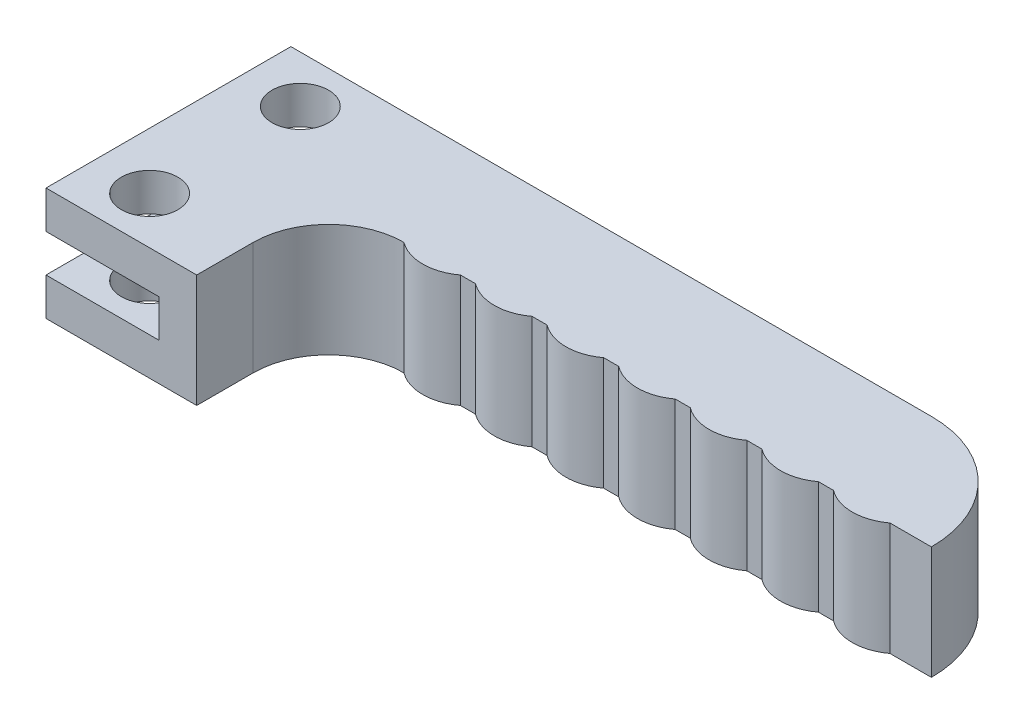
ISO-10303-21;
HEADER;
FILE_DESCRIPTION(('STEP AP214'),'2;1');
FILE_NAME('part.step','',(''),(''),'','','');
FILE_SCHEMA(('AUTOMOTIVE_DESIGN { 1 0 10303 214 1 1 1 1 }'));
ENDSEC;
DATA;
#1=APPLICATION_CONTEXT('core data for automotive mechanical design processes');
#2=APPLICATION_PROTOCOL_DEFINITION('international standard','automotive_design',2000,#1);
#3=PRODUCT_CONTEXT('',#1,'mechanical');
#4=PRODUCT('Part','Part','',(#3));
#5=PRODUCT_RELATED_PRODUCT_CATEGORY('part','',(#4));
#6=PRODUCT_DEFINITION_FORMATION('','',#4);
#7=PRODUCT_DEFINITION_CONTEXT('part definition',#1,'design');
#8=PRODUCT_DEFINITION('design','',#6,#7);
#9=PRODUCT_DEFINITION_SHAPE('','',#8);
#10=(LENGTH_UNIT() NAMED_UNIT(*) SI_UNIT(.MILLI.,.METRE.));
#11=(NAMED_UNIT(*) PLANE_ANGLE_UNIT() SI_UNIT($,.RADIAN.));
#12=(NAMED_UNIT(*) SI_UNIT($,.STERADIAN.) SOLID_ANGLE_UNIT());
#13=UNCERTAINTY_MEASURE_WITH_UNIT(LENGTH_MEASURE(1.E-05),#10,'distance_accuracy_value','');
#14=(GEOMETRIC_REPRESENTATION_CONTEXT(3) GLOBAL_UNCERTAINTY_ASSIGNED_CONTEXT((#13)) GLOBAL_UNIT_ASSIGNED_CONTEXT((#10,
#11,#12)) REPRESENTATION_CONTEXT('',''));
#15=CARTESIAN_POINT('',(0.,0.,0.));
#16=DIRECTION('',(0.,0.,1.));
#17=DIRECTION('',(1.,0.,0.));
#18=AXIS2_PLACEMENT_3D('',#15,#16,#17);
#19=CARTESIAN_POINT('',(4.89999999999997,0.,-2.50000000000009));
#20=DIRECTION('',(0.,1.,0.));
#21=DIRECTION('',(0.,0.,1.));
#22=AXIS2_PLACEMENT_3D('',#19,#20,#21);
#23=CYLINDRICAL_SURFACE('',#22,2.5);
#24=CARTESIAN_POINT('',(4.89999999999997,6.,-2.50000000000009));
#25=DIRECTION('',(0.,1.,0.));
#26=DIRECTION('',(0.,0.,1.));
#27=AXIS2_PLACEMENT_3D('',#24,#25,#26);
#28=CIRCLE('',#27,2.5);
#29=CARTESIAN_POINT('',(6.39999999999991,6.,-0.500000000000001));
#30=VERTEX_POINT('',#29);
#31=CARTESIAN_POINT('',(3.40000000000003,6.,-0.500000000000001));
#32=VERTEX_POINT('',#31);
#33=EDGE_CURVE('E118',#30,#32,#28,.F.);
#34=ORIENTED_EDGE('',*,*,#33,.T.);
#35=DIRECTION('',(0.,1.,0.));
#36=VECTOR('',#35,1.);
#37=CARTESIAN_POINT('',(3.39999999999998,0.,-0.500000000000001));
#38=LINE('',#37,#36);
#39=CARTESIAN_POINT('',(3.40000000000003,0.,-0.500000000000001));
#40=VERTEX_POINT('',#39);
#41=EDGE_CURVE('E128',#32,#40,#38,.F.);
#42=ORIENTED_EDGE('',*,*,#41,.T.);
#43=CARTESIAN_POINT('',(4.89999999999997,0.,-2.50000000000009));
#44=DIRECTION('',(0.,1.,0.));
#45=DIRECTION('',(0.,0.,1.));
#46=AXIS2_PLACEMENT_3D('',#43,#44,#45);
#47=CIRCLE('',#46,2.5);
#48=CARTESIAN_POINT('',(6.39999999999991,0.,-0.500000000000001));
#49=VERTEX_POINT('',#48);
#50=EDGE_CURVE('E20',#40,#49,#47,.T.);
#51=ORIENTED_EDGE('',*,*,#50,.T.);
#52=DIRECTION('',(0.,1.,0.));
#53=VECTOR('',#52,1.);
#54=CARTESIAN_POINT('',(6.39999999999996,0.,-0.500000000000001));
#55=LINE('',#54,#53);
#56=EDGE_CURVE('E125',#49,#30,#55,.T.);
#57=ORIENTED_EDGE('',*,*,#56,.T.);
#58=EDGE_LOOP('',(#34,#42,#51,#57));
#59=FACE_BOUND('',#58,.T.);
#60=ADVANCED_FACE('F17',(#59),#23,.T.);
#61=CARTESIAN_POINT('',(20.,0.,-0.500000000000003));
#62=DIRECTION('',(0.,0.,-1.));
#63=DIRECTION('',(-1.,0.,0.));
#64=AXIS2_PLACEMENT_3D('',#61,#62,#63);
#65=PLANE('',#64);
#66=ORIENTED_EDGE('',*,*,#56,.F.);
#67=DIRECTION('',(-1.,0.,0.));
#68=VECTOR('',#67,1.);
#69=CARTESIAN_POINT('',(20.,0.,-0.500000000000003));
#70=LINE('',#69,#68);
#71=CARTESIAN_POINT('',(7.20000000000005,0.,-0.500000000000054));
#72=VERTEX_POINT('',#71);
#73=EDGE_CURVE('E133',#72,#49,#70,.T.);
#74=ORIENTED_EDGE('',*,*,#73,.F.);
#75=DIRECTION('',(0.,1.,0.));
#76=VECTOR('',#75,1.);
#77=CARTESIAN_POINT('',(7.19999999999998,0.,-0.500000000000106));
#78=LINE('',#77,#76);
#79=CARTESIAN_POINT('',(7.20000000000005,6.,-0.500000000000054));
#80=VERTEX_POINT('',#79);
#81=EDGE_CURVE('E227',#80,#72,#78,.F.);
#82=ORIENTED_EDGE('',*,*,#81,.F.);
#83=DIRECTION('',(-1.,0.,0.));
#84=VECTOR('',#83,1.);
#85=CARTESIAN_POINT('',(20.,6.,-0.500000000000003));
#86=LINE('',#85,#84);
#87=EDGE_CURVE('E144',#30,#80,#86,.F.);
#88=ORIENTED_EDGE('',*,*,#87,.F.);
#89=EDGE_LOOP('',(#66,#74,#82,#88));
#90=FACE_BOUND('',#89,.T.);
#91=ADVANCED_FACE('F143',(#90),#65,.F.);
#92=CARTESIAN_POINT('',(20.,0.,-0.500000000000003));
#93=DIRECTION('',(0.,0.,-1.));
#94=DIRECTION('',(-1.,0.,0.));
#95=AXIS2_PLACEMENT_3D('',#92,#93,#94);
#96=PLANE('',#95);
#97=DIRECTION('',(0.,1.,0.));
#98=VECTOR('',#97,1.);
#99=CARTESIAN_POINT('',(2.59999999999995,0.,-0.500000000000053));
#100=LINE('',#99,#98);
#101=CARTESIAN_POINT('',(2.59999999999992,0.,-0.500000000000027));
#102=VERTEX_POINT('',#101);
#103=CARTESIAN_POINT('',(2.59999999999992,6.,-0.500000000000027));
#104=VERTEX_POINT('',#103);
#105=EDGE_CURVE('E218',#102,#104,#100,.T.);
#106=ORIENTED_EDGE('',*,*,#105,.F.);
#107=DIRECTION('',(-1.,0.,0.));
#108=VECTOR('',#107,1.);
#109=CARTESIAN_POINT('',(20.,0.,-0.500000000000003));
#110=LINE('',#109,#108);
#111=EDGE_CURVE('E228',#40,#102,#110,.T.);
#112=ORIENTED_EDGE('',*,*,#111,.F.);
#113=ORIENTED_EDGE('',*,*,#41,.F.);
#114=DIRECTION('',(-1.,0.,0.));
#115=VECTOR('',#114,1.);
#116=CARTESIAN_POINT('',(20.,6.,-0.500000000000003));
#117=LINE('',#116,#115);
#118=EDGE_CURVE('E220',#104,#32,#117,.F.);
#119=ORIENTED_EDGE('',*,*,#118,.F.);
#120=EDGE_LOOP('',(#106,#112,#113,#119));
#121=FACE_BOUND('',#120,.T.);
#122=ADVANCED_FACE('F230',(#121),#96,.F.);
#123=CARTESIAN_POINT('',(8.69999999999997,0.,-2.50000000000012));
#124=DIRECTION('',(0.,1.,0.));
#125=DIRECTION('',(0.,0.,1.));
#126=AXIS2_PLACEMENT_3D('',#123,#124,#125);
#127=CYLINDRICAL_SURFACE('',#126,2.5);
#128=DIRECTION('',(0.,1.,0.));
#129=VECTOR('',#128,1.);
#130=CARTESIAN_POINT('',(10.2,0.,-0.500000000000002));
#131=LINE('',#130,#129);
#132=CARTESIAN_POINT('',(10.1999999999999,0.,-0.500000000000002));
#133=VERTEX_POINT('',#132);
#134=CARTESIAN_POINT('',(10.1999999999999,6.,-0.500000000000002));
#135=VERTEX_POINT('',#134);
#136=EDGE_CURVE('E237',#133,#135,#131,.T.);
#137=ORIENTED_EDGE('',*,*,#136,.T.);
#138=CARTESIAN_POINT('',(8.69999999999997,6.,-2.50000000000012));
#139=DIRECTION('',(0.,1.,0.));
#140=DIRECTION('',(0.,0.,1.));
#141=AXIS2_PLACEMENT_3D('',#138,#139,#140);
#142=CIRCLE('',#141,2.5);
#143=EDGE_CURVE('E216',#135,#80,#142,.F.);
#144=ORIENTED_EDGE('',*,*,#143,.T.);
#145=ORIENTED_EDGE('',*,*,#81,.T.);
#146=CARTESIAN_POINT('',(8.69999999999997,0.,-2.50000000000012));
#147=DIRECTION('',(0.,1.,0.));
#148=DIRECTION('',(0.,0.,1.));
#149=AXIS2_PLACEMENT_3D('',#146,#147,#148);
#150=CIRCLE('',#149,2.5);
#151=EDGE_CURVE('E138',#72,#133,#150,.T.);
#152=ORIENTED_EDGE('',*,*,#151,.T.);
#153=EDGE_LOOP('',(#137,#144,#145,#152));
#154=FACE_BOUND('',#153,.T.);
#155=ADVANCED_FACE('F468',(#154),#127,.T.);
#156=CARTESIAN_POINT('',(1.09999999999997,0.,-2.50000000000006));
#157=DIRECTION('',(0.,1.,0.));
#158=DIRECTION('',(0.,0.,1.));
#159=AXIS2_PLACEMENT_3D('',#156,#157,#158);
#160=CYLINDRICAL_SURFACE('',#159,2.5);
#161=CARTESIAN_POINT('',(1.09999999999997,6.,-2.50000000000006));
#162=DIRECTION('',(0.,1.,0.));
#163=DIRECTION('',(0.,0.,1.));
#164=AXIS2_PLACEMENT_3D('',#161,#162,#163);
#165=CIRCLE('',#164,2.5);
#166=CARTESIAN_POINT('',(-0.399999999999987,6.,-0.500000000000001));
#167=VERTEX_POINT('',#166);
#168=EDGE_CURVE('E211',#104,#167,#165,.F.);
#169=ORIENTED_EDGE('',*,*,#168,.T.);
#170=DIRECTION('',(0.,1.,0.));
#171=VECTOR('',#170,1.);
#172=CARTESIAN_POINT('',(-0.400000000000022,0.,-0.500000000000001));
#173=LINE('',#172,#171);
#174=CARTESIAN_POINT('',(-0.399999999999987,0.,-0.500000000000001));
#175=VERTEX_POINT('',#174);
#176=EDGE_CURVE('E241',#167,#175,#173,.F.);
#177=ORIENTED_EDGE('',*,*,#176,.T.);
#178=CARTESIAN_POINT('',(1.09999999999997,0.,-2.50000000000006));
#179=DIRECTION('',(0.,1.,0.));
#180=DIRECTION('',(0.,0.,1.));
#181=AXIS2_PLACEMENT_3D('',#178,#179,#180);
#182=CIRCLE('',#181,2.5);
#183=EDGE_CURVE('E214',#175,#102,#182,.T.);
#184=ORIENTED_EDGE('',*,*,#183,.T.);
#185=ORIENTED_EDGE('',*,*,#105,.T.);
#186=EDGE_LOOP('',(#169,#177,#184,#185));
#187=FACE_BOUND('',#186,.T.);
#188=ADVANCED_FACE('F470',(#187),#160,.T.);
#189=CARTESIAN_POINT('',(20.,0.,-0.500000000000003));
#190=DIRECTION('',(0.,0.,-1.));
#191=DIRECTION('',(-1.,0.,0.));
#192=AXIS2_PLACEMENT_3D('',#189,#190,#191);
#193=PLANE('',#192);
#194=ORIENTED_EDGE('',*,*,#136,.F.);
#195=DIRECTION('',(-1.,0.,0.));
#196=VECTOR('',#195,1.);
#197=CARTESIAN_POINT('',(20.,0.,-0.500000000000003));
#198=LINE('',#197,#196);
#199=CARTESIAN_POINT('',(11.0000000000001,0.,-0.500000000000067));
#200=VERTEX_POINT('',#199);
#201=EDGE_CURVE('E213',#200,#133,#198,.T.);
#202=ORIENTED_EDGE('',*,*,#201,.F.);
#203=DIRECTION('',(0.,1.,0.));
#204=VECTOR('',#203,1.);
#205=CARTESIAN_POINT('',(11.,0.,-0.500000000000132));
#206=LINE('',#205,#204);
#207=CARTESIAN_POINT('',(11.0000000000001,6.,-0.500000000000067));
#208=VERTEX_POINT('',#207);
#209=EDGE_CURVE('E248',#208,#200,#206,.F.);
#210=ORIENTED_EDGE('',*,*,#209,.F.);
#211=DIRECTION('',(-1.,0.,0.));
#212=VECTOR('',#211,1.);
#213=CARTESIAN_POINT('',(20.,6.,-0.500000000000003));
#214=LINE('',#213,#212);
#215=EDGE_CURVE('E240',#135,#208,#214,.F.);
#216=ORIENTED_EDGE('',*,*,#215,.F.);
#217=EDGE_LOOP('',(#194,#202,#210,#216));
#218=FACE_BOUND('',#217,.T.);
#219=ADVANCED_FACE('F467',(#218),#193,.F.);
#220=CARTESIAN_POINT('',(20.,0.,-0.500000000000003));
#221=DIRECTION('',(0.,0.,-1.));
#222=DIRECTION('',(-1.,0.,0.));
#223=AXIS2_PLACEMENT_3D('',#220,#221,#222);
#224=PLANE('',#223);
#225=DIRECTION('',(0.,1.,0.));
#226=VECTOR('',#225,1.);
#227=CARTESIAN_POINT('',(-1.20000000000005,0.,-0.500000000000025));
#228=LINE('',#227,#226);
#229=CARTESIAN_POINT('',(-1.20000000000006,0.,-0.500000000000013));
#230=VERTEX_POINT('',#229);
#231=CARTESIAN_POINT('',(-1.20000000000006,6.,-0.500000000000013));
#232=VERTEX_POINT('',#231);
#233=EDGE_CURVE('E210',#230,#232,#228,.T.);
#234=ORIENTED_EDGE('',*,*,#233,.F.);
#235=DIRECTION('',(-1.,0.,0.));
#236=VECTOR('',#235,1.);
#237=CARTESIAN_POINT('',(20.,0.,-0.500000000000003));
#238=LINE('',#237,#236);
#239=EDGE_CURVE('E244',#175,#230,#238,.T.);
#240=ORIENTED_EDGE('',*,*,#239,.F.);
#241=ORIENTED_EDGE('',*,*,#176,.F.);
#242=DIRECTION('',(-1.,0.,0.));
#243=VECTOR('',#242,1.);
#244=CARTESIAN_POINT('',(20.,6.,-0.500000000000003));
#245=LINE('',#244,#243);
#246=EDGE_CURVE('E251',#232,#167,#245,.F.);
#247=ORIENTED_EDGE('',*,*,#246,.F.);
#248=EDGE_LOOP('',(#234,#240,#241,#247));
#249=FACE_BOUND('',#248,.T.);
#250=ADVANCED_FACE('F560',(#249),#224,.F.);
#251=CARTESIAN_POINT('',(12.5,0.,-2.50000000000015));
#252=DIRECTION('',(0.,1.,0.));
#253=DIRECTION('',(0.,0.,1.));
#254=AXIS2_PLACEMENT_3D('',#251,#252,#253);
#255=CYLINDRICAL_SURFACE('',#254,2.5);
#256=DIRECTION('',(0.,1.,0.));
#257=VECTOR('',#256,1.);
#258=CARTESIAN_POINT('',(14.,0.,-0.500000000000002));
#259=LINE('',#258,#257);
#260=CARTESIAN_POINT('',(13.9999999999999,0.,-0.500000000000002));
#261=VERTEX_POINT('',#260);
#262=CARTESIAN_POINT('',(13.9999999999999,6.,-0.500000000000002));
#263=VERTEX_POINT('',#262);
#264=EDGE_CURVE('E257',#261,#263,#259,.T.);
#265=ORIENTED_EDGE('',*,*,#264,.T.);
#266=CARTESIAN_POINT('',(12.5,6.,-2.50000000000015));
#267=DIRECTION('',(0.,1.,0.));
#268=DIRECTION('',(0.,0.,1.));
#269=AXIS2_PLACEMENT_3D('',#266,#267,#268);
#270=CIRCLE('',#269,2.5);
#271=EDGE_CURVE('E205',#263,#208,#270,.F.);
#272=ORIENTED_EDGE('',*,*,#271,.T.);
#273=ORIENTED_EDGE('',*,*,#209,.T.);
#274=CARTESIAN_POINT('',(12.5,0.,-2.50000000000015));
#275=DIRECTION('',(0.,1.,0.));
#276=DIRECTION('',(0.,0.,1.));
#277=AXIS2_PLACEMENT_3D('',#274,#275,#276);
#278=CIRCLE('',#277,2.5);
#279=EDGE_CURVE('E207',#200,#261,#278,.T.);
#280=ORIENTED_EDGE('',*,*,#279,.T.);
#281=EDGE_LOOP('',(#265,#272,#273,#280));
#282=FACE_BOUND('',#281,.T.);
#283=ADVANCED_FACE('F462',(#282),#255,.T.);
#284=CARTESIAN_POINT('',(-2.70000000000003,0.,-2.50000000000004));
#285=DIRECTION('',(0.,1.,0.));
#286=DIRECTION('',(0.,0.,1.));
#287=AXIS2_PLACEMENT_3D('',#284,#285,#286);
#288=CYLINDRICAL_SURFACE('',#287,2.5);
#289=CARTESIAN_POINT('',(-2.70000000000003,6.,-2.50000000000004));
#290=DIRECTION('',(0.,1.,0.));
#291=DIRECTION('',(0.,0.,1.));
#292=AXIS2_PLACEMENT_3D('',#289,#290,#291);
#293=CIRCLE('',#292,2.5);
#294=CARTESIAN_POINT('',(-4.2,6.,-0.5));
#295=VERTEX_POINT('',#294);
#296=EDGE_CURVE('E200',#232,#295,#293,.F.);
#297=ORIENTED_EDGE('',*,*,#296,.T.);
#298=DIRECTION('',(0.,1.,0.));
#299=VECTOR('',#298,1.);
#300=CARTESIAN_POINT('',(-4.20000000000002,0.,-0.5));
#301=LINE('',#300,#299);
#302=CARTESIAN_POINT('',(-4.2,0.,-0.5));
#303=VERTEX_POINT('',#302);
#304=EDGE_CURVE('E261',#295,#303,#301,.F.);
#305=ORIENTED_EDGE('',*,*,#304,.T.);
#306=CARTESIAN_POINT('',(-2.70000000000003,0.,-2.50000000000004));
#307=DIRECTION('',(0.,1.,0.));
#308=DIRECTION('',(0.,0.,1.));
#309=AXIS2_PLACEMENT_3D('',#306,#307,#308);
#310=CIRCLE('',#309,2.5);
#311=EDGE_CURVE('E203',#303,#230,#310,.T.);
#312=ORIENTED_EDGE('',*,*,#311,.T.);
#313=ORIENTED_EDGE('',*,*,#233,.T.);
#314=EDGE_LOOP('',(#297,#305,#312,#313));
#315=FACE_BOUND('',#314,.T.);
#316=ADVANCED_FACE('F554',(#315),#288,.T.);
#317=CARTESIAN_POINT('',(20.,0.,-0.500000000000003));
#318=DIRECTION('',(0.,0.,-1.));
#319=DIRECTION('',(-1.,0.,0.));
#320=AXIS2_PLACEMENT_3D('',#317,#318,#319);
#321=PLANE('',#320);
#322=ORIENTED_EDGE('',*,*,#264,.F.);
#323=DIRECTION('',(-1.,0.,0.));
#324=VECTOR('',#323,1.);
#325=CARTESIAN_POINT('',(20.,0.,-0.500000000000003));
#326=LINE('',#325,#324);
#327=CARTESIAN_POINT('',(14.8000000000001,0.,-0.50000000000008));
#328=VERTEX_POINT('',#327);
#329=EDGE_CURVE('E202',#328,#261,#326,.T.);
#330=ORIENTED_EDGE('',*,*,#329,.F.);
#331=DIRECTION('',(0.,1.,0.));
#332=VECTOR('',#331,1.);
#333=CARTESIAN_POINT('',(14.8,0.,-0.500000000000158));
#334=LINE('',#333,#332);
#335=CARTESIAN_POINT('',(14.8000000000001,6.,-0.50000000000008));
#336=VERTEX_POINT('',#335);
#337=EDGE_CURVE('E267',#336,#328,#334,.F.);
#338=ORIENTED_EDGE('',*,*,#337,.F.);
#339=DIRECTION('',(-1.,0.,0.));
#340=VECTOR('',#339,1.);
#341=CARTESIAN_POINT('',(20.,6.,-0.500000000000003));
#342=LINE('',#341,#340);
#343=EDGE_CURVE('E260',#263,#336,#342,.F.);
#344=ORIENTED_EDGE('',*,*,#343,.F.);
#345=EDGE_LOOP('',(#322,#330,#338,#344));
#346=FACE_BOUND('',#345,.T.);
#347=ADVANCED_FACE('F459',(#346),#321,.F.);
#348=CARTESIAN_POINT('',(20.,0.,-0.500000000000003));
#349=DIRECTION('',(0.,0.,-1.));
#350=DIRECTION('',(-1.,0.,0.));
#351=AXIS2_PLACEMENT_3D('',#348,#349,#350);
#352=PLANE('',#351);
#353=DIRECTION('',(0.,1.,0.));
#354=VECTOR('',#353,1.);
#355=CARTESIAN_POINT('',(-5.00000000000004,0.,-0.5));
#356=LINE('',#355,#354);
#357=CARTESIAN_POINT('',(-5.00000000000004,0.,-0.5));
#358=VERTEX_POINT('',#357);
#359=CARTESIAN_POINT('',(-5.00000000000004,6.,-0.5));
#360=VERTEX_POINT('',#359);
#361=EDGE_CURVE('E199',#358,#360,#356,.T.);
#362=ORIENTED_EDGE('',*,*,#361,.F.);
#363=DIRECTION('',(-1.,0.,0.));
#364=VECTOR('',#363,1.);
#365=CARTESIAN_POINT('',(20.,0.,-0.500000000000003));
#366=LINE('',#365,#364);
#367=EDGE_CURVE('E264',#303,#358,#366,.T.);
#368=ORIENTED_EDGE('',*,*,#367,.F.);
#369=ORIENTED_EDGE('',*,*,#304,.F.);
#370=DIRECTION('',(-1.,0.,0.));
#371=VECTOR('',#370,1.);
#372=CARTESIAN_POINT('',(20.,6.,-0.500000000000003));
#373=LINE('',#372,#371);
#374=EDGE_CURVE('E270',#360,#295,#373,.F.);
#375=ORIENTED_EDGE('',*,*,#374,.F.);
#376=EDGE_LOOP('',(#362,#368,#369,#375));
#377=FACE_BOUND('',#376,.T.);
#378=ADVANCED_FACE('F547',(#377),#352,.F.);
#379=CARTESIAN_POINT('',(-17.,0.,4.));
#380=DIRECTION('',(0.,1.,0.));
#381=DIRECTION('',(0.,0.,1.));
#382=AXIS2_PLACEMENT_3D('',#379,#380,#381);
#383=CYLINDRICAL_SURFACE('',#382,1.5);
#384=CARTESIAN_POINT('',(-17.,0.,4.));
#385=DIRECTION('',(0.,1.,0.));
#386=DIRECTION('',(0.,0.,1.));
#387=AXIS2_PLACEMENT_3D('',#384,#385,#386);
#388=CIRCLE('',#387,1.5);
#389=CARTESIAN_POINT('',(-17.,0.,5.5));
#390=VERTEX_POINT('',#389);
#391=EDGE_CURVE('E185',#390,#390,#388,.F.);
#392=ORIENTED_EDGE('',*,*,#391,.T.);
#393=EDGE_LOOP('',(#392));
#394=FACE_BOUND('',#393,.T.);
#395=CARTESIAN_POINT('',(-17.,2.,4.));
#396=DIRECTION('',(0.,1.,0.));
#397=DIRECTION('',(0.,0.,1.));
#398=AXIS2_PLACEMENT_3D('',#395,#396,#397);
#399=CIRCLE('',#398,1.5);
#400=CARTESIAN_POINT('',(-17.,2.,5.5));
#401=VERTEX_POINT('',#400);
#402=EDGE_CURVE('E194',#401,#401,#399,.T.);
#403=ORIENTED_EDGE('',*,*,#402,.T.);
#404=EDGE_LOOP('',(#403));
#405=FACE_BOUND('',#404,.T.);
#406=ADVANCED_FACE('F543',(#394,#405),#383,.F.);
#407=CARTESIAN_POINT('',(-17.,0.,-4.));
#408=DIRECTION('',(0.,1.,0.));
#409=DIRECTION('',(0.,0.,1.));
#410=AXIS2_PLACEMENT_3D('',#407,#408,#409);
#411=CYLINDRICAL_SURFACE('',#410,1.5);
#412=CARTESIAN_POINT('',(-17.,0.,-4.));
#413=DIRECTION('',(0.,1.,0.));
#414=DIRECTION('',(0.,0.,1.));
#415=AXIS2_PLACEMENT_3D('',#412,#413,#414);
#416=CIRCLE('',#415,1.5);
#417=CARTESIAN_POINT('',(-17.,0.,-2.5));
#418=VERTEX_POINT('',#417);
#419=EDGE_CURVE('E182',#418,#418,#416,.F.);
#420=ORIENTED_EDGE('',*,*,#419,.T.);
#421=EDGE_LOOP('',(#420));
#422=FACE_BOUND('',#421,.T.);
#423=CARTESIAN_POINT('',(-17.,2.,-4.));
#424=DIRECTION('',(0.,1.,0.));
#425=DIRECTION('',(0.,0.,1.));
#426=AXIS2_PLACEMENT_3D('',#423,#424,#425);
#427=CIRCLE('',#426,1.5);
#428=CARTESIAN_POINT('',(-17.,2.,-2.5));
#429=VERTEX_POINT('',#428);
#430=EDGE_CURVE('E190',#429,#429,#427,.T.);
#431=ORIENTED_EDGE('',*,*,#430,.T.);
#432=EDGE_LOOP('',(#431));
#433=FACE_BOUND('',#432,.T.);
#434=ADVANCED_FACE('F540',(#422,#433),#411,.F.);
#435=CARTESIAN_POINT('',(16.3,0.,-2.50000000000018));
#436=DIRECTION('',(0.,1.,0.));
#437=DIRECTION('',(0.,0.,1.));
#438=AXIS2_PLACEMENT_3D('',#435,#436,#437);
#439=CYLINDRICAL_SURFACE('',#438,2.5);
#440=DIRECTION('',(0.,1.,0.));
#441=VECTOR('',#440,1.);
#442=CARTESIAN_POINT('',(17.7999999999999,0.,-0.500000000000003));
#443=LINE('',#442,#441);
#444=CARTESIAN_POINT('',(17.7999999999998,0.,-0.500000000000003));
#445=VERTEX_POINT('',#444);
#446=CARTESIAN_POINT('',(17.7999999999998,6.,-0.500000000000003));
#447=VERTEX_POINT('',#446);
#448=EDGE_CURVE('E279',#445,#447,#443,.T.);
#449=ORIENTED_EDGE('',*,*,#448,.T.);
#450=CARTESIAN_POINT('',(16.3,6.,-2.50000000000018));
#451=DIRECTION('',(0.,1.,0.));
#452=DIRECTION('',(0.,0.,1.));
#453=AXIS2_PLACEMENT_3D('',#450,#451,#452);
#454=CIRCLE('',#453,2.5);
#455=EDGE_CURVE('E197',#447,#336,#454,.F.);
#456=ORIENTED_EDGE('',*,*,#455,.T.);
#457=ORIENTED_EDGE('',*,*,#337,.T.);
#458=CARTESIAN_POINT('',(16.3,0.,-2.50000000000018));
#459=DIRECTION('',(0.,1.,0.));
#460=DIRECTION('',(0.,0.,1.));
#461=AXIS2_PLACEMENT_3D('',#458,#459,#460);
#462=CIRCLE('',#461,2.5);
#463=EDGE_CURVE('E175',#328,#445,#462,.T.);
#464=ORIENTED_EDGE('',*,*,#463,.T.);
#465=EDGE_LOOP('',(#449,#456,#457,#464));
#466=FACE_BOUND('',#465,.T.);
#467=ADVANCED_FACE('F448',(#466),#439,.T.);
#468=CARTESIAN_POINT('',(-20.,6.,6.5));
#469=DIRECTION('',(1.,0.,0.));
#470=DIRECTION('',(0.,0.,-1.));
#471=AXIS2_PLACEMENT_3D('',#468,#469,#470);
#472=PLANE('',#471);
#473=DIRECTION('',(0.,0.,-1.));
#474=VECTOR('',#473,1.);
#475=CARTESIAN_POINT('',(-20.,2.,-6.5));
#476=LINE('',#475,#474);
#477=CARTESIAN_POINT('',(-20.,2.,6.5));
#478=VERTEX_POINT('',#477);
#479=CARTESIAN_POINT('',(-20.,2.,-6.5));
#480=VERTEX_POINT('',#479);
#481=EDGE_CURVE('E193',#478,#480,#476,.T.);
#482=ORIENTED_EDGE('',*,*,#481,.T.);
#483=DIRECTION('',(0.,1.,0.));
#484=VECTOR('',#483,1.);
#485=CARTESIAN_POINT('',(-20.,6.,-6.5));
#486=LINE('',#485,#484);
#487=CARTESIAN_POINT('',(-20.,0.,-6.5));
#488=VERTEX_POINT('',#487);
#489=EDGE_CURVE('E290',#480,#488,#486,.F.);
#490=ORIENTED_EDGE('',*,*,#489,.T.);
#491=DIRECTION('',(0.,0.,1.));
#492=VECTOR('',#491,1.);
#493=CARTESIAN_POINT('',(-20.,0.,0.));
#494=LINE('',#493,#492);
#495=CARTESIAN_POINT('',(-20.,0.,6.5));
#496=VERTEX_POINT('',#495);
#497=EDGE_CURVE('E181',#488,#496,#494,.T.);
#498=ORIENTED_EDGE('',*,*,#497,.T.);
#499=DIRECTION('',(0.,1.,0.));
#500=VECTOR('',#499,1.);
#501=CARTESIAN_POINT('',(-20.,6.,6.5));
#502=LINE('',#501,#500);
#503=EDGE_CURVE('E315',#496,#478,#502,.T.);
#504=ORIENTED_EDGE('',*,*,#503,.T.);
#505=EDGE_LOOP('',(#482,#490,#498,#504));
#506=FACE_BOUND('',#505,.T.);
#507=ADVANCED_FACE('F533',(#506),#472,.F.);
#508=CARTESIAN_POINT('',(-20.,2.,-6.5));
#509=DIRECTION('',(0.,-1.,0.));
#510=DIRECTION('',(0.,0.,-1.));
#511=AXIS2_PLACEMENT_3D('',#508,#509,#510);
#512=PLANE('',#511);
#513=DIRECTION('',(0.,0.,-1.));
#514=VECTOR('',#513,1.);
#515=CARTESIAN_POINT('',(-14.,2.,-6.5));
#516=LINE('',#515,#514);
#517=CARTESIAN_POINT('',(-14.,2.,6.5));
#518=VERTEX_POINT('',#517);
#519=CARTESIAN_POINT('',(-14.,2.,-6.5));
#520=VERTEX_POINT('',#519);
#521=EDGE_CURVE('E189',#518,#520,#516,.T.);
#522=ORIENTED_EDGE('',*,*,#521,.T.);
#523=DIRECTION('',(1.,0.,0.));
#524=VECTOR('',#523,1.);
#525=CARTESIAN_POINT('',(20.,2.,-6.5));
#526=LINE('',#525,#524);
#527=EDGE_CURVE('E285',#520,#480,#526,.F.);
#528=ORIENTED_EDGE('',*,*,#527,.T.);
#529=ORIENTED_EDGE('',*,*,#481,.F.);
#530=DIRECTION('',(-1.,0.,0.));
#531=VECTOR('',#530,1.);
#532=CARTESIAN_POINT('',(20.,2.,6.5));
#533=LINE('',#532,#531);
#534=EDGE_CURVE('E311',#478,#518,#533,.F.);
#535=ORIENTED_EDGE('',*,*,#534,.T.);
#536=EDGE_LOOP('',(#522,#528,#529,#535));
#537=FACE_BOUND('',#536,.T.);
#538=ORIENTED_EDGE('',*,*,#430,.F.);
#539=EDGE_LOOP('',(#538));
#540=FACE_BOUND('',#539,.T.);
#541=ORIENTED_EDGE('',*,*,#402,.F.);
#542=EDGE_LOOP('',(#541));
#543=FACE_BOUND('',#542,.T.);
#544=ADVANCED_FACE('F529',(#537,#540,#543),#512,.F.);
#545=CARTESIAN_POINT('',(-14.,4.,-6.5));
#546=DIRECTION('',(1.,0.,0.));
#547=DIRECTION('',(0.,0.,-1.));
#548=AXIS2_PLACEMENT_3D('',#545,#546,#547);
#549=PLANE('',#548);
#550=DIRECTION('',(0.,0.,1.));
#551=VECTOR('',#550,1.);
#552=CARTESIAN_POINT('',(-14.,4.,-6.5));
#553=LINE('',#552,#551);
#554=CARTESIAN_POINT('',(-14.,4.,6.5));
#555=VERTEX_POINT('',#554);
#556=CARTESIAN_POINT('',(-14.,4.,-6.5));
#557=VERTEX_POINT('',#556);
#558=EDGE_CURVE('E178',#555,#557,#553,.F.);
#559=ORIENTED_EDGE('',*,*,#558,.T.);
#560=DIRECTION('',(0.,1.,0.));
#561=VECTOR('',#560,1.);
#562=CARTESIAN_POINT('',(-14.,6.,-6.5));
#563=LINE('',#562,#561);
#564=EDGE_CURVE('E282',#557,#520,#563,.F.);
#565=ORIENTED_EDGE('',*,*,#564,.T.);
#566=ORIENTED_EDGE('',*,*,#521,.F.);
#567=DIRECTION('',(0.,1.,0.));
#568=VECTOR('',#567,1.);
#569=CARTESIAN_POINT('',(-14.,6.,6.5));
#570=LINE('',#569,#568);
#571=EDGE_CURVE('E314',#518,#555,#570,.T.);
#572=ORIENTED_EDGE('',*,*,#571,.T.);
#573=EDGE_LOOP('',(#559,#565,#566,#572));
#574=FACE_BOUND('',#573,.T.);
#575=ADVANCED_FACE('F526',(#574),#549,.F.);
#576=CARTESIAN_POINT('',(-6.50000000000003,0.,-2.50000000000002));
#577=DIRECTION('',(0.,1.,0.));
#578=DIRECTION('',(0.,0.,1.));
#579=AXIS2_PLACEMENT_3D('',#576,#577,#578);
#580=CYLINDRICAL_SURFACE('',#579,2.50000000000001);
#581=CARTESIAN_POINT('',(-6.50000000000003,6.,-2.50000000000002));
#582=DIRECTION('',(0.,1.,0.));
#583=DIRECTION('',(0.,0.,1.));
#584=AXIS2_PLACEMENT_3D('',#581,#582,#583);
#585=CIRCLE('',#584,2.50000000000001);
#586=CARTESIAN_POINT('',(-8.00000000000001,6.,-0.5));
#587=VERTEX_POINT('',#586);
#588=EDGE_CURVE('E35',#360,#587,#585,.F.);
#589=ORIENTED_EDGE('',*,*,#588,.T.);
#590=DIRECTION('',(0.,-1.,0.));
#591=VECTOR('',#590,1.);
#592=CARTESIAN_POINT('',(-8.,0.,-0.5));
#593=LINE('',#592,#591);
#594=CARTESIAN_POINT('',(-8.00000000000001,0.,-0.5));
#595=VERTEX_POINT('',#594);
#596=EDGE_CURVE('E169',#587,#595,#593,.T.);
#597=ORIENTED_EDGE('',*,*,#596,.T.);
#598=CARTESIAN_POINT('',(-6.50000000000003,0.,-2.50000000000002));
#599=DIRECTION('',(0.,1.,0.));
#600=DIRECTION('',(0.,0.,1.));
#601=AXIS2_PLACEMENT_3D('',#598,#599,#600);
#602=CIRCLE('',#601,2.50000000000001);
#603=EDGE_CURVE('E179',#595,#358,#602,.T.);
#604=ORIENTED_EDGE('',*,*,#603,.T.);
#605=ORIENTED_EDGE('',*,*,#361,.T.);
#606=EDGE_LOOP('',(#589,#597,#604,#605));
#607=FACE_BOUND('',#606,.T.);
#608=ADVANCED_FACE('F523',(#607),#580,.T.);
#609=CARTESIAN_POINT('',(0.,0.,0.));
#610=DIRECTION('',(0.,1.,0.));
#611=DIRECTION('',(0.,0.,1.));
#612=AXIS2_PLACEMENT_3D('',#609,#610,#611);
#613=PLANE('',#612);
#614=CARTESIAN_POINT('',(14.,0.,-0.500000000000001));
#615=DIRECTION('',(0.,-1.,0.));
#616=DIRECTION('',(0.,0.,-1.));
#617=AXIS2_PLACEMENT_3D('',#614,#615,#616);
#618=CIRCLE('',#617,6.);
#619=CARTESIAN_POINT('',(20.,0.,-0.500000000000003));
#620=VERTEX_POINT('',#619);
#621=CARTESIAN_POINT('',(14.,0.,-6.5));
#622=VERTEX_POINT('',#621);
#623=EDGE_CURVE('E170',#620,#622,#618,.F.);
#624=ORIENTED_EDGE('',*,*,#623,.F.);
#625=DIRECTION('',(-1.,0.,0.));
#626=VECTOR('',#625,1.);
#627=CARTESIAN_POINT('',(20.,0.,-0.500000000000003));
#628=LINE('',#627,#626);
#629=EDGE_CURVE('E276',#620,#445,#628,.T.);
#630=ORIENTED_EDGE('',*,*,#629,.T.);
#631=ORIENTED_EDGE('',*,*,#463,.F.);
#632=ORIENTED_EDGE('',*,*,#329,.T.);
#633=ORIENTED_EDGE('',*,*,#279,.F.);
#634=ORIENTED_EDGE('',*,*,#201,.T.);
#635=ORIENTED_EDGE('',*,*,#151,.F.);
#636=ORIENTED_EDGE('',*,*,#73,.T.);
#637=ORIENTED_EDGE('',*,*,#50,.F.);
#638=ORIENTED_EDGE('',*,*,#111,.T.);
#639=ORIENTED_EDGE('',*,*,#183,.F.);
#640=ORIENTED_EDGE('',*,*,#239,.T.);
#641=ORIENTED_EDGE('',*,*,#311,.F.);
#642=ORIENTED_EDGE('',*,*,#367,.T.);
#643=ORIENTED_EDGE('',*,*,#603,.F.);
#644=CARTESIAN_POINT('',(-8.,0.,3.5));
#645=DIRECTION('',(0.,-1.,0.));
#646=DIRECTION('',(0.,0.,-1.));
#647=AXIS2_PLACEMENT_3D('',#644,#645,#646);
#648=CIRCLE('',#647,4.);
#649=CARTESIAN_POINT('',(-12.,0.,3.5));
#650=VERTEX_POINT('',#649);
#651=EDGE_CURVE('E166',#595,#650,#648,.F.);
#652=ORIENTED_EDGE('',*,*,#651,.T.);
#653=DIRECTION('',(0.,0.,1.));
#654=VECTOR('',#653,1.);
#655=CARTESIAN_POINT('',(-12.,0.,6.5));
#656=LINE('',#655,#654);
#657=CARTESIAN_POINT('',(-12.,0.,6.5));
#658=VERTEX_POINT('',#657);
#659=EDGE_CURVE('E356',#650,#658,#656,.T.);
#660=ORIENTED_EDGE('',*,*,#659,.T.);
#661=DIRECTION('',(-1.,0.,0.));
#662=VECTOR('',#661,1.);
#663=CARTESIAN_POINT('',(20.,0.,6.5));
#664=LINE('',#663,#662);
#665=EDGE_CURVE('E350',#658,#496,#664,.T.);
#666=ORIENTED_EDGE('',*,*,#665,.T.);
#667=ORIENTED_EDGE('',*,*,#497,.F.);
#668=DIRECTION('',(1.,0.,0.));
#669=VECTOR('',#668,1.);
#670=CARTESIAN_POINT('',(20.,0.,-6.5));
#671=LINE('',#670,#669);
#672=EDGE_CURVE('E295',#488,#622,#671,.T.);
#673=ORIENTED_EDGE('',*,*,#672,.T.);
#674=EDGE_LOOP('',(#624,#630,#631,#632,#633,#634,#635,#636,#637,#638,#639,#640,#641,#642,#643,
#652,#660,#666,#667,#673));
#675=FACE_BOUND('',#674,.T.);
#676=ORIENTED_EDGE('',*,*,#419,.F.);
#677=EDGE_LOOP('',(#676));
#678=FACE_BOUND('',#677,.T.);
#679=ORIENTED_EDGE('',*,*,#391,.F.);
#680=EDGE_LOOP('',(#679));
#681=FACE_BOUND('',#680,.T.);
#682=ADVANCED_FACE('F135',(#675,#678,#681),#613,.F.);
#683=CARTESIAN_POINT('',(-20.,4.,-6.5));
#684=DIRECTION('',(0.,1.,0.));
#685=DIRECTION('',(-1.,0.,0.));
#686=AXIS2_PLACEMENT_3D('',#683,#684,#685);
#687=PLANE('',#686);
#688=DIRECTION('',(0.,0.,-1.));
#689=VECTOR('',#688,1.);
#690=CARTESIAN_POINT('',(-20.,4.,6.5));
#691=LINE('',#690,#689);
#692=CARTESIAN_POINT('',(-20.,4.,6.5));
#693=VERTEX_POINT('',#692);
#694=CARTESIAN_POINT('',(-20.,4.,-6.5));
#695=VERTEX_POINT('',#694);
#696=EDGE_CURVE('E336',#693,#695,#691,.T.);
#697=ORIENTED_EDGE('',*,*,#696,.T.);
#698=DIRECTION('',(1.,0.,0.));
#699=VECTOR('',#698,1.);
#700=CARTESIAN_POINT('',(20.,4.,-6.5));
#701=LINE('',#700,#699);
#702=EDGE_CURVE('E173',#695,#557,#701,.T.);
#703=ORIENTED_EDGE('',*,*,#702,.T.);
#704=ORIENTED_EDGE('',*,*,#558,.F.);
#705=DIRECTION('',(-1.,0.,0.));
#706=VECTOR('',#705,1.);
#707=CARTESIAN_POINT('',(20.,4.,6.5));
#708=LINE('',#707,#706);
#709=EDGE_CURVE('E324',#555,#693,#708,.T.);
#710=ORIENTED_EDGE('',*,*,#709,.T.);
#711=EDGE_LOOP('',(#697,#703,#704,#710));
#712=FACE_BOUND('',#711,.T.);
#713=CARTESIAN_POINT('',(-17.,4.,-4.));
#714=DIRECTION('',(0.,1.,0.));
#715=DIRECTION('',(0.,0.,1.));
#716=AXIS2_PLACEMENT_3D('',#713,#714,#715);
#717=CIRCLE('',#716,1.5);
#718=CARTESIAN_POINT('',(-17.,4.,-2.5));
#719=VERTEX_POINT('',#718);
#720=EDGE_CURVE('E160',#719,#719,#717,.T.);
#721=ORIENTED_EDGE('',*,*,#720,.T.);
#722=EDGE_LOOP('',(#721));
#723=FACE_BOUND('',#722,.T.);
#724=CARTESIAN_POINT('',(-17.,4.,4.));
#725=DIRECTION('',(0.,1.,0.));
#726=DIRECTION('',(0.,0.,1.));
#727=AXIS2_PLACEMENT_3D('',#724,#725,#726);
#728=CIRCLE('',#727,1.5);
#729=CARTESIAN_POINT('',(-17.,4.,5.5));
#730=VERTEX_POINT('',#729);
#731=EDGE_CURVE('E163',#730,#730,#728,.T.);
#732=ORIENTED_EDGE('',*,*,#731,.T.);
#733=EDGE_LOOP('',(#732));
#734=FACE_BOUND('',#733,.T.);
#735=ADVANCED_FACE('F517',(#712,#723,#734),#687,.F.);
#736=CARTESIAN_POINT('',(20.,0.,-0.500000000000003));
#737=DIRECTION('',(0.,0.,-1.));
#738=DIRECTION('',(-1.,0.,0.));
#739=AXIS2_PLACEMENT_3D('',#736,#737,#738);
#740=PLANE('',#739);
#741=ORIENTED_EDGE('',*,*,#448,.F.);
#742=ORIENTED_EDGE('',*,*,#629,.F.);
#743=DIRECTION('',(0.,-1.,0.));
#744=VECTOR('',#743,1.);
#745=CARTESIAN_POINT('',(20.,6.,-0.500000000000003));
#746=LINE('',#745,#744);
#747=CARTESIAN_POINT('',(20.,6.,-0.500000000000003));
#748=VERTEX_POINT('',#747);
#749=EDGE_CURVE('E174',#748,#620,#746,.T.);
#750=ORIENTED_EDGE('',*,*,#749,.F.);
#751=DIRECTION('',(1.,0.,0.));
#752=VECTOR('',#751,1.);
#753=CARTESIAN_POINT('',(0.,6.,-0.500000000000003));
#754=LINE('',#753,#752);
#755=EDGE_CURVE('E159',#447,#748,#754,.T.);
#756=ORIENTED_EDGE('',*,*,#755,.F.);
#757=EDGE_LOOP('',(#741,#742,#750,#756));
#758=FACE_BOUND('',#757,.T.);
#759=ADVANCED_FACE('F454',(#758),#740,.F.);
#760=CARTESIAN_POINT('',(14.,6.,-0.500000000000001));
#761=DIRECTION('',(0.,-1.,0.));
#762=DIRECTION('',(0.,0.,-1.));
#763=AXIS2_PLACEMENT_3D('',#760,#761,#762);
#764=CYLINDRICAL_SURFACE('',#763,6.);
#765=ORIENTED_EDGE('',*,*,#623,.T.);
#766=DIRECTION('',(0.,1.,0.));
#767=VECTOR('',#766,1.);
#768=CARTESIAN_POINT('',(14.,6.,-6.5));
#769=LINE('',#768,#767);
#770=CARTESIAN_POINT('',(14.,6.,-6.5));
#771=VERTEX_POINT('',#770);
#772=EDGE_CURVE('E300',#622,#771,#769,.T.);
#773=ORIENTED_EDGE('',*,*,#772,.T.);
#774=CARTESIAN_POINT('',(14.,6.,-0.500000000000001));
#775=DIRECTION('',(0.,-1.,0.));
#776=DIRECTION('',(0.,0.,-1.));
#777=AXIS2_PLACEMENT_3D('',#774,#775,#776);
#778=CIRCLE('',#777,6.);
#779=EDGE_CURVE('E155',#748,#771,#778,.F.);
#780=ORIENTED_EDGE('',*,*,#779,.F.);
#781=ORIENTED_EDGE('',*,*,#749,.T.);
#782=EDGE_LOOP('',(#765,#773,#780,#781));
#783=FACE_BOUND('',#782,.T.);
#784=ADVANCED_FACE('F510',(#783),#764,.T.);
#785=CARTESIAN_POINT('',(20.,6.,-6.5));
#786=DIRECTION('',(0.,0.,1.));
#787=DIRECTION('',(1.,0.,0.));
#788=AXIS2_PLACEMENT_3D('',#785,#786,#787);
#789=PLANE('',#788);
#790=ORIENTED_EDGE('',*,*,#772,.F.);
#791=ORIENTED_EDGE('',*,*,#672,.F.);
#792=ORIENTED_EDGE('',*,*,#489,.F.);
#793=ORIENTED_EDGE('',*,*,#527,.F.);
#794=ORIENTED_EDGE('',*,*,#564,.F.);
#795=ORIENTED_EDGE('',*,*,#702,.F.);
#796=DIRECTION('',(0.,1.,0.));
#797=VECTOR('',#796,1.);
#798=CARTESIAN_POINT('',(-20.,6.,-6.5));
#799=LINE('',#798,#797);
#800=CARTESIAN_POINT('',(-20.,6.,-6.5));
#801=VERTEX_POINT('',#800);
#802=EDGE_CURVE('E339',#695,#801,#799,.T.);
#803=ORIENTED_EDGE('',*,*,#802,.T.);
#804=DIRECTION('',(1.,0.,0.));
#805=VECTOR('',#804,1.);
#806=CARTESIAN_POINT('',(0.,6.,-6.5));
#807=LINE('',#806,#805);
#808=EDGE_CURVE('E158',#771,#801,#807,.F.);
#809=ORIENTED_EDGE('',*,*,#808,.F.);
#810=EDGE_LOOP('',(#790,#791,#792,#793,#794,#795,#803,#809));
#811=FACE_BOUND('',#810,.T.);
#812=ADVANCED_FACE('F506',(#811),#789,.F.);
#813=CARTESIAN_POINT('',(-20.,6.,6.5));
#814=DIRECTION('',(1.,0.,0.));
#815=DIRECTION('',(0.,0.,-1.));
#816=AXIS2_PLACEMENT_3D('',#813,#814,#815);
#817=PLANE('',#816);
#818=ORIENTED_EDGE('',*,*,#696,.F.);
#819=DIRECTION('',(0.,1.,0.));
#820=VECTOR('',#819,1.);
#821=CARTESIAN_POINT('',(-20.,6.,6.5));
#822=LINE('',#821,#820);
#823=CARTESIAN_POINT('',(-20.,6.,6.5));
#824=VERTEX_POINT('',#823);
#825=EDGE_CURVE('E333',#693,#824,#822,.T.);
#826=ORIENTED_EDGE('',*,*,#825,.T.);
#827=DIRECTION('',(0.,0.,1.));
#828=VECTOR('',#827,1.);
#829=CARTESIAN_POINT('',(-20.,6.,0.));
#830=LINE('',#829,#828);
#831=EDGE_CURVE('E372',#801,#824,#830,.T.);
#832=ORIENTED_EDGE('',*,*,#831,.F.);
#833=ORIENTED_EDGE('',*,*,#802,.F.);
#834=EDGE_LOOP('',(#818,#826,#832,#833));
#835=FACE_BOUND('',#834,.T.);
#836=ADVANCED_FACE('F503',(#835),#817,.F.);
#837=CARTESIAN_POINT('',(20.,6.,6.5));
#838=DIRECTION('',(0.,0.,-1.));
#839=DIRECTION('',(-1.,0.,0.));
#840=AXIS2_PLACEMENT_3D('',#837,#838,#839);
#841=PLANE('',#840);
#842=DIRECTION('',(0.,1.,0.));
#843=VECTOR('',#842,1.);
#844=CARTESIAN_POINT('',(-12.,0.,6.5));
#845=LINE('',#844,#843);
#846=CARTESIAN_POINT('',(-12.,6.,6.5));
#847=VERTEX_POINT('',#846);
#848=EDGE_CURVE('E353',#658,#847,#845,.T.);
#849=ORIENTED_EDGE('',*,*,#848,.T.);
#850=DIRECTION('',(1.,0.,0.));
#851=VECTOR('',#850,1.);
#852=CARTESIAN_POINT('',(0.,6.,6.5));
#853=LINE('',#852,#851);
#854=EDGE_CURVE('E375',#824,#847,#853,.T.);
#855=ORIENTED_EDGE('',*,*,#854,.F.);
#856=ORIENTED_EDGE('',*,*,#825,.F.);
#857=ORIENTED_EDGE('',*,*,#709,.F.);
#858=ORIENTED_EDGE('',*,*,#571,.F.);
#859=ORIENTED_EDGE('',*,*,#534,.F.);
#860=ORIENTED_EDGE('',*,*,#503,.F.);
#861=ORIENTED_EDGE('',*,*,#665,.F.);
#862=EDGE_LOOP('',(#849,#855,#856,#857,#858,#859,#860,#861));
#863=FACE_BOUND('',#862,.T.);
#864=ADVANCED_FACE('F500',(#863),#841,.F.);
#865=CARTESIAN_POINT('',(-12.,0.,6.5));
#866=DIRECTION('',(-1.,0.,0.));
#867=DIRECTION('',(0.,0.,1.));
#868=AXIS2_PLACEMENT_3D('',#865,#866,#867);
#869=PLANE('',#868);
#870=DIRECTION('',(0.,-1.,0.));
#871=VECTOR('',#870,1.);
#872=CARTESIAN_POINT('',(-12.,0.,3.5));
#873=LINE('',#872,#871);
#874=CARTESIAN_POINT('',(-12.,6.,3.5));
#875=VERTEX_POINT('',#874);
#876=EDGE_CURVE('E359',#650,#875,#873,.F.);
#877=ORIENTED_EDGE('',*,*,#876,.T.);
#878=DIRECTION('',(0.,0.,1.));
#879=VECTOR('',#878,1.);
#880=CARTESIAN_POINT('',(-12.,6.,0.));
#881=LINE('',#880,#879);
#882=EDGE_CURVE('E154',#847,#875,#881,.F.);
#883=ORIENTED_EDGE('',*,*,#882,.F.);
#884=ORIENTED_EDGE('',*,*,#848,.F.);
#885=ORIENTED_EDGE('',*,*,#659,.F.);
#886=EDGE_LOOP('',(#877,#883,#884,#885));
#887=FACE_BOUND('',#886,.T.);
#888=ADVANCED_FACE('F404',(#887),#869,.F.);
#889=CARTESIAN_POINT('',(-8.,0.,3.5));
#890=DIRECTION('',(0.,-1.,0.));
#891=DIRECTION('',(0.,0.,-1.));
#892=AXIS2_PLACEMENT_3D('',#889,#890,#891);
#893=CYLINDRICAL_SURFACE('',#892,4.);
#894=ORIENTED_EDGE('',*,*,#596,.F.);
#895=CARTESIAN_POINT('',(-8.,6.,3.5));
#896=DIRECTION('',(0.,-1.,0.));
#897=DIRECTION('',(0.,0.,-1.));
#898=AXIS2_PLACEMENT_3D('',#895,#896,#897);
#899=CIRCLE('',#898,4.);
#900=EDGE_CURVE('E151',#875,#587,#899,.T.);
#901=ORIENTED_EDGE('',*,*,#900,.F.);
#902=ORIENTED_EDGE('',*,*,#876,.F.);
#903=ORIENTED_EDGE('',*,*,#651,.F.);
#904=EDGE_LOOP('',(#894,#901,#902,#903));
#905=FACE_BOUND('',#904,.T.);
#906=ADVANCED_FACE('F493',(#905),#893,.F.);
#907=CARTESIAN_POINT('',(-17.,4.,4.));
#908=DIRECTION('',(0.,1.,0.));
#909=DIRECTION('',(0.,0.,1.));
#910=AXIS2_PLACEMENT_3D('',#907,#908,#909);
#911=CYLINDRICAL_SURFACE('',#910,1.5);
#912=CARTESIAN_POINT('',(-17.,6.,4.));
#913=DIRECTION('',(0.,1.,0.));
#914=DIRECTION('',(0.,0.,1.));
#915=AXIS2_PLACEMENT_3D('',#912,#913,#914);
#916=CIRCLE('',#915,1.5);
#917=CARTESIAN_POINT('',(-17.,6.,5.5));
#918=VERTEX_POINT('',#917);
#919=EDGE_CURVE('E26',#918,#918,#916,.F.);
#920=ORIENTED_EDGE('',*,*,#919,.F.);
#921=EDGE_LOOP('',(#920));
#922=FACE_BOUND('',#921,.T.);
#923=ORIENTED_EDGE('',*,*,#731,.F.);
#924=EDGE_LOOP('',(#923));
#925=FACE_BOUND('',#924,.T.);
#926=ADVANCED_FACE('F486',(#922,#925),#911,.F.);
#927=CARTESIAN_POINT('',(-17.,4.,-4.));
#928=DIRECTION('',(0.,1.,0.));
#929=DIRECTION('',(0.,0.,1.));
#930=AXIS2_PLACEMENT_3D('',#927,#928,#929);
#931=CYLINDRICAL_SURFACE('',#930,1.5);
#932=CARTESIAN_POINT('',(-17.,6.,-4.));
#933=DIRECTION('',(0.,1.,0.));
#934=DIRECTION('',(0.,0.,1.));
#935=AXIS2_PLACEMENT_3D('',#932,#933,#934);
#936=CIRCLE('',#935,1.5);
#937=CARTESIAN_POINT('',(-17.,6.,-2.5));
#938=VERTEX_POINT('',#937);
#939=EDGE_CURVE('E11',#938,#938,#936,.F.);
#940=ORIENTED_EDGE('',*,*,#939,.F.);
#941=EDGE_LOOP('',(#940));
#942=FACE_BOUND('',#941,.T.);
#943=ORIENTED_EDGE('',*,*,#720,.F.);
#944=EDGE_LOOP('',(#943));
#945=FACE_BOUND('',#944,.T.);
#946=ADVANCED_FACE('F480',(#942,#945),#931,.F.);
#947=CARTESIAN_POINT('',(0.,6.,0.));
#948=DIRECTION('',(0.,1.,0.));
#949=DIRECTION('',(0.,0.,1.));
#950=AXIS2_PLACEMENT_3D('',#947,#948,#949);
#951=PLANE('',#950);
#952=ORIENTED_EDGE('',*,*,#939,.T.);
#953=EDGE_LOOP('',(#952));
#954=FACE_BOUND('',#953,.T.);
#955=ORIENTED_EDGE('',*,*,#919,.T.);
#956=EDGE_LOOP('',(#955));
#957=FACE_BOUND('',#956,.T.);
#958=ORIENTED_EDGE('',*,*,#343,.T.);
#959=ORIENTED_EDGE('',*,*,#455,.F.);
#960=ORIENTED_EDGE('',*,*,#755,.T.);
#961=ORIENTED_EDGE('',*,*,#779,.T.);
#962=ORIENTED_EDGE('',*,*,#808,.T.);
#963=ORIENTED_EDGE('',*,*,#831,.T.);
#964=ORIENTED_EDGE('',*,*,#854,.T.);
#965=ORIENTED_EDGE('',*,*,#882,.T.);
#966=ORIENTED_EDGE('',*,*,#900,.T.);
#967=ORIENTED_EDGE('',*,*,#588,.F.);
#968=ORIENTED_EDGE('',*,*,#374,.T.);
#969=ORIENTED_EDGE('',*,*,#296,.F.);
#970=ORIENTED_EDGE('',*,*,#246,.T.);
#971=ORIENTED_EDGE('',*,*,#168,.F.);
#972=ORIENTED_EDGE('',*,*,#118,.T.);
#973=ORIENTED_EDGE('',*,*,#33,.F.);
#974=ORIENTED_EDGE('',*,*,#87,.T.);
#975=ORIENTED_EDGE('',*,*,#143,.F.);
#976=ORIENTED_EDGE('',*,*,#215,.T.);
#977=ORIENTED_EDGE('',*,*,#271,.F.);
#978=EDGE_LOOP('',(#958,#959,#960,#961,#962,#963,#964,#965,#966,#967,#968,#969,#970,#971,#972,
#973,#974,#975,#976,#977));
#979=FACE_BOUND('',#978,.T.);
#980=ADVANCED_FACE('F222',(#954,#957,#979),#951,.T.);
#981=CLOSED_SHELL('',(#60,#91,#122,#155,#188,#219,#250,#283,#316,#347,#378,#406,#434,#467,#507,
#544,#575,#608,#682,#735,#759,#784,#812,#836,#864,#888,#906,#926,#946,#980));
#982=MANIFOLD_SOLID_BREP('B1',#981);
#983=ADVANCED_BREP_SHAPE_REPRESENTATION('',(#18,#982),#14);
#984=SHAPE_DEFINITION_REPRESENTATION(#9,#983);
ENDSEC;
END-ISO-10303-21;
